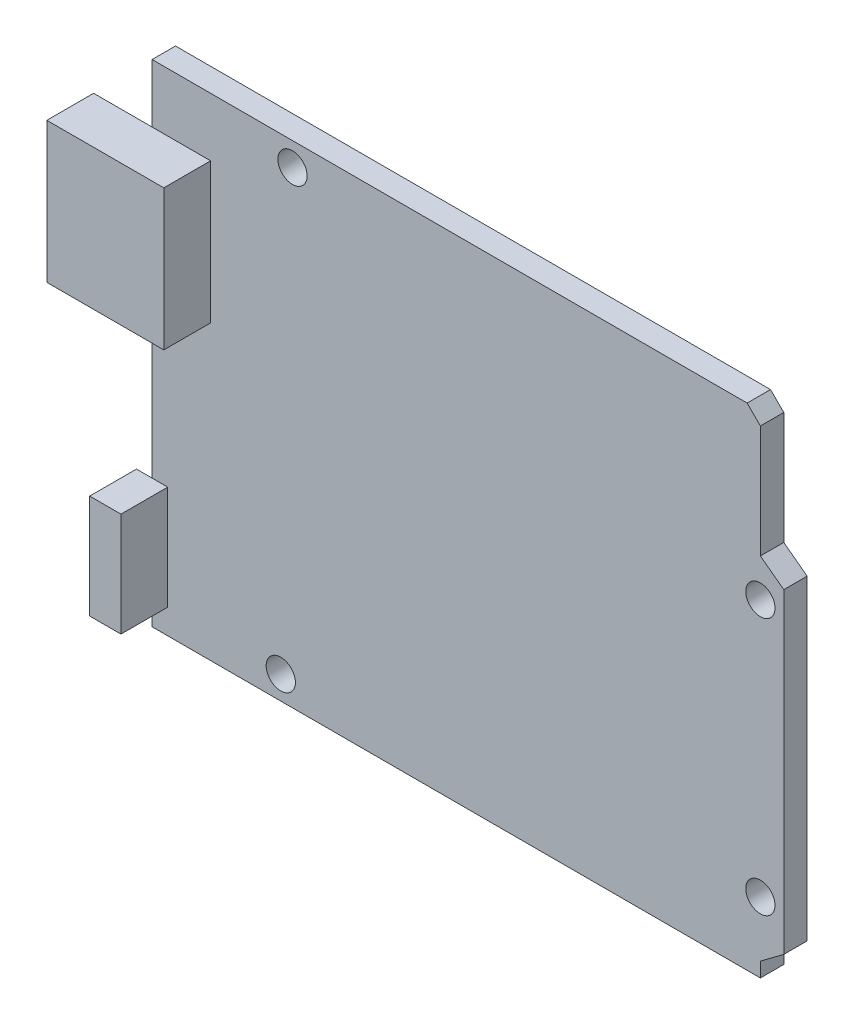
ISO-10303-21;
HEADER;
FILE_DESCRIPTION(('STEP AP214'),'2;1');
FILE_NAME('part.step','',(''),(''),'','','');
FILE_SCHEMA(('AUTOMOTIVE_DESIGN { 1 0 10303 214 1 1 1 1 }'));
ENDSEC;
DATA;
#1=APPLICATION_CONTEXT('core data for automotive mechanical design processes');
#2=APPLICATION_PROTOCOL_DEFINITION('international standard','automotive_design',2000,#1);
#3=PRODUCT_CONTEXT('',#1,'mechanical');
#4=PRODUCT('Part','Part','',(#3));
#5=PRODUCT_RELATED_PRODUCT_CATEGORY('part','',(#4));
#6=PRODUCT_DEFINITION_FORMATION('','',#4);
#7=PRODUCT_DEFINITION_CONTEXT('part definition',#1,'design');
#8=PRODUCT_DEFINITION('design','',#6,#7);
#9=PRODUCT_DEFINITION_SHAPE('','',#8);
#10=(LENGTH_UNIT() NAMED_UNIT(*) SI_UNIT(.MILLI.,.METRE.));
#11=(NAMED_UNIT(*) PLANE_ANGLE_UNIT() SI_UNIT($,.RADIAN.));
#12=(NAMED_UNIT(*) SI_UNIT($,.STERADIAN.) SOLID_ANGLE_UNIT());
#13=UNCERTAINTY_MEASURE_WITH_UNIT(LENGTH_MEASURE(1.E-05),#10,'distance_accuracy_value','');
#14=(GEOMETRIC_REPRESENTATION_CONTEXT(3) GLOBAL_UNCERTAINTY_ASSIGNED_CONTEXT((#13)) GLOBAL_UNIT_ASSIGNED_CONTEXT((#10,
#11,#12)) REPRESENTATION_CONTEXT('',''));
#15=CARTESIAN_POINT('',(0.,0.,0.));
#16=DIRECTION('',(0.,0.,1.));
#17=DIRECTION('',(1.,0.,0.));
#18=AXIS2_PLACEMENT_3D('',#15,#16,#17);
#19=CARTESIAN_POINT('',(0.,0.,2.54));
#20=DIRECTION('',(0.,0.,-1.));
#21=DIRECTION('',(-1.,0.,0.));
#22=AXIS2_PLACEMENT_3D('',#19,#20,#21);
#23=PLANE('',#22);
#24=CARTESIAN_POINT('',(-19.05,24.13,2.54));
#25=DIRECTION('',(0.,0.,1.));
#26=DIRECTION('',(1.,0.,0.));
#27=AXIS2_PLACEMENT_3D('',#24,#25,#26);
#28=CIRCLE('',#27,1.5875);
#29=CARTESIAN_POINT('',(-17.4625,24.13,2.54));
#30=VERTEX_POINT('',#29);
#31=EDGE_CURVE('E213',#30,#30,#28,.T.);
#32=ORIENTED_EDGE('',*,*,#31,.F.);
#33=EDGE_LOOP('',(#32));
#34=FACE_BOUND('',#33,.T.);
#35=CARTESIAN_POINT('',(31.75,-19.05,2.54));
#36=DIRECTION('',(0.,0.,1.));
#37=DIRECTION('',(1.,0.,0.));
#38=AXIS2_PLACEMENT_3D('',#35,#36,#37);
#39=CIRCLE('',#38,1.5875);
#40=CARTESIAN_POINT('',(33.3375,-19.05,2.54));
#41=VERTEX_POINT('',#40);
#42=EDGE_CURVE('E316',#41,#41,#39,.T.);
#43=ORIENTED_EDGE('',*,*,#42,.F.);
#44=EDGE_LOOP('',(#43));
#45=FACE_BOUND('',#44,.T.);
#46=CARTESIAN_POINT('',(31.75,8.89,2.54));
#47=DIRECTION('',(0.,0.,1.));
#48=DIRECTION('',(1.,0.,0.));
#49=AXIS2_PLACEMENT_3D('',#46,#47,#48);
#50=CIRCLE('',#49,1.5875);
#51=CARTESIAN_POINT('',(33.3375,8.89,2.54));
#52=VERTEX_POINT('',#51);
#53=EDGE_CURVE('E319',#52,#52,#50,.T.);
#54=ORIENTED_EDGE('',*,*,#53,.F.);
#55=EDGE_LOOP('',(#54));
#56=FACE_BOUND('',#55,.T.);
#57=CARTESIAN_POINT('',(-20.32,-24.13,2.54));
#58=DIRECTION('',(0.,0.,1.));
#59=DIRECTION('',(1.,0.,0.));
#60=AXIS2_PLACEMENT_3D('',#57,#58,#59);
#61=CIRCLE('',#60,1.5875);
#62=CARTESIAN_POINT('',(-18.7325,-24.13,2.54));
#63=VERTEX_POINT('',#62);
#64=EDGE_CURVE('E315',#63,#63,#61,.T.);
#65=ORIENTED_EDGE('',*,*,#64,.F.);
#66=EDGE_LOOP('',(#65));
#67=FACE_BOUND('',#66,.T.);
#68=DIRECTION('',(0.,1.,0.));
#69=VECTOR('',#68,1.);
#70=CARTESIAN_POINT('',(34.29,-26.67,2.54));
#71=LINE('',#70,#69);
#72=CARTESIAN_POINT('',(34.29,-23.1815470961268,2.54));
#73=VERTEX_POINT('',#72);
#74=CARTESIAN_POINT('',(34.29,11.1157964472055,2.54));
#75=VERTEX_POINT('',#74);
#76=EDGE_CURVE('E203',#73,#75,#71,.T.);
#77=ORIENTED_EDGE('',*,*,#76,.T.);
#78=DIRECTION('',(0.801223892096283,-0.598364667016765,0.));
#79=VECTOR('',#78,1.);
#80=CARTESIAN_POINT('',(31.75,13.0127022549518,2.54));
#81=LINE('',#80,#79);
#82=CARTESIAN_POINT('',(31.75,13.0127022549518,2.54));
#83=VERTEX_POINT('',#82);
#84=EDGE_CURVE('E175',#83,#75,#81,.T.);
#85=ORIENTED_EDGE('',*,*,#84,.F.);
#86=DIRECTION('',(0.,-1.,0.));
#87=VECTOR('',#86,1.);
#88=CARTESIAN_POINT('',(31.75,13.0127022549518,2.54));
#89=LINE('',#88,#87);
#90=CARTESIAN_POINT('',(31.75,25.2331590206289,2.54));
#91=VERTEX_POINT('',#90);
#92=EDGE_CURVE('E305',#91,#83,#89,.T.);
#93=ORIENTED_EDGE('',*,*,#92,.F.);
#94=DIRECTION('',(0.707106781186552,-0.707106781186543,0.));
#95=VECTOR('',#94,1.);
#96=CARTESIAN_POINT('',(30.3131590206289,26.67,2.54));
#97=LINE('',#96,#95);
#98=CARTESIAN_POINT('',(30.3131590206289,26.67,2.54));
#99=VERTEX_POINT('',#98);
#100=EDGE_CURVE('E302',#99,#91,#97,.T.);
#101=ORIENTED_EDGE('',*,*,#100,.F.);
#102=DIRECTION('',(-1.,0.,0.));
#103=VECTOR('',#102,1.);
#104=CARTESIAN_POINT('',(-34.29,26.67,2.54));
#105=LINE('',#104,#103);
#106=CARTESIAN_POINT('',(-34.29,26.67,2.54));
#107=VERTEX_POINT('',#106);
#108=EDGE_CURVE('E183',#99,#107,#105,.T.);
#109=ORIENTED_EDGE('',*,*,#108,.T.);
#110=DIRECTION('',(0.,-1.,0.));
#111=VECTOR('',#110,1.);
#112=CARTESIAN_POINT('',(-34.29,-26.67,2.54));
#113=LINE('',#112,#111);
#114=CARTESIAN_POINT('',(-34.29,20.32,2.54));
#115=VERTEX_POINT('',#114);
#116=EDGE_CURVE('E288',#107,#115,#113,.T.);
#117=ORIENTED_EDGE('',*,*,#116,.T.);
#118=DIRECTION('',(-1.,0.,0.));
#119=VECTOR('',#118,1.);
#120=CARTESIAN_POINT('',(-40.64,20.32,2.54));
#121=LINE('',#120,#119);
#122=CARTESIAN_POINT('',(-27.94,20.32,2.54));
#123=VERTEX_POINT('',#122);
#124=EDGE_CURVE('E268',#123,#115,#121,.T.);
#125=ORIENTED_EDGE('',*,*,#124,.F.);
#126=DIRECTION('',(0.,1.,0.));
#127=VECTOR('',#126,1.);
#128=CARTESIAN_POINT('',(-27.94,5.08,2.54));
#129=LINE('',#128,#127);
#130=CARTESIAN_POINT('',(-27.94,5.08,2.54));
#131=VERTEX_POINT('',#130);
#132=EDGE_CURVE('E254',#131,#123,#129,.T.);
#133=ORIENTED_EDGE('',*,*,#132,.F.);
#134=DIRECTION('',(1.,0.,0.));
#135=VECTOR('',#134,1.);
#136=CARTESIAN_POINT('',(-40.64,5.08,2.54));
#137=LINE('',#136,#135);
#138=CARTESIAN_POINT('',(-34.29,5.08,2.54));
#139=VERTEX_POINT('',#138);
#140=EDGE_CURVE('E11',#139,#131,#137,.T.);
#141=ORIENTED_EDGE('',*,*,#140,.F.);
#142=CARTESIAN_POINT('',(-34.29,-12.6860049869124,2.54));
#143=VERTEX_POINT('',#142);
#144=EDGE_CURVE('E355',#139,#143,#113,.T.);
#145=ORIENTED_EDGE('',*,*,#144,.T.);
#146=DIRECTION('',(-1.,0.,0.));
#147=VECTOR('',#146,1.);
#148=CARTESIAN_POINT('',(-35.9875181952427,-12.6860049869124,2.54));
#149=LINE('',#148,#147);
#150=CARTESIAN_POINT('',(-32.5924818047572,-12.6860049869124,2.54));
#151=VERTEX_POINT('',#150);
#152=EDGE_CURVE('E229',#151,#143,#149,.T.);
#153=ORIENTED_EDGE('',*,*,#152,.F.);
#154=DIRECTION('',(0.,1.,0.));
#155=VECTOR('',#154,1.);
#156=CARTESIAN_POINT('',(-32.5924818047572,-23.9715545871231,2.54));
#157=LINE('',#156,#155);
#158=CARTESIAN_POINT('',(-32.5924818047572,-23.9715545871231,2.54));
#159=VERTEX_POINT('',#158);
#160=EDGE_CURVE('E220',#159,#151,#157,.T.);
#161=ORIENTED_EDGE('',*,*,#160,.F.);
#162=DIRECTION('',(1.,0.,0.));
#163=VECTOR('',#162,1.);
#164=CARTESIAN_POINT('',(-35.9875181952427,-23.9715545871231,2.54));
#165=LINE('',#164,#163);
#166=CARTESIAN_POINT('',(-34.29,-23.9715545871231,2.54));
#167=VERTEX_POINT('',#166);
#168=EDGE_CURVE('E238',#167,#159,#165,.T.);
#169=ORIENTED_EDGE('',*,*,#168,.F.);
#170=CARTESIAN_POINT('',(-34.29,-26.67,2.54));
#171=VERTEX_POINT('',#170);
#172=EDGE_CURVE('E287',#167,#171,#113,.T.);
#173=ORIENTED_EDGE('',*,*,#172,.T.);
#174=DIRECTION('',(1.,0.,0.));
#175=VECTOR('',#174,1.);
#176=CARTESIAN_POINT('',(-34.29,-26.67,2.54));
#177=LINE('',#176,#175);
#178=CARTESIAN_POINT('',(31.75,-26.67,2.54));
#179=VERTEX_POINT('',#178);
#180=EDGE_CURVE('E207',#171,#179,#177,.T.);
#181=ORIENTED_EDGE('',*,*,#180,.T.);
#182=DIRECTION('',(0.,-1.,0.));
#183=VECTOR('',#182,1.);
#184=CARTESIAN_POINT('',(31.75,-25.0784529038732,2.54));
#185=LINE('',#184,#183);
#186=CARTESIAN_POINT('',(31.75,-25.0784529038732,2.54));
#187=VERTEX_POINT('',#186);
#188=EDGE_CURVE('E295',#187,#179,#185,.T.);
#189=ORIENTED_EDGE('',*,*,#188,.F.);
#190=DIRECTION('',(-0.801223892096282,-0.598364667016766,0.));
#191=VECTOR('',#190,1.);
#192=CARTESIAN_POINT('',(34.29,-23.1815470961268,2.54));
#193=LINE('',#192,#191);
#194=EDGE_CURVE('E616',#73,#187,#193,.T.);
#195=ORIENTED_EDGE('',*,*,#194,.F.);
#196=EDGE_LOOP('',(#77,#85,#93,#101,#109,#117,#125,#133,#141,#145,#153,#161,#169,#173,#181,#189,#195));
#197=FACE_BOUND('',#196,.T.);
#198=ADVANCED_FACE('F33',(#34,#45,#56,#67,#197),#23,.F.);
#199=CARTESIAN_POINT('',(34.29,-26.67,2.54));
#200=DIRECTION('',(-1.,0.,0.));
#201=DIRECTION('',(0.,0.,1.));
#202=AXIS2_PLACEMENT_3D('',#199,#200,#201);
#203=PLANE('',#202);
#204=DIRECTION('',(0.,1.,0.));
#205=VECTOR('',#204,1.);
#206=CARTESIAN_POINT('',(34.29,-26.67,0.));
#207=LINE('',#206,#205);
#208=CARTESIAN_POINT('',(34.29,-23.1815470961268,0.));
#209=VERTEX_POINT('',#208);
#210=CARTESIAN_POINT('',(34.29,11.1157964472055,0.));
#211=VERTEX_POINT('',#210);
#212=EDGE_CURVE('E192',#209,#211,#207,.T.);
#213=ORIENTED_EDGE('',*,*,#212,.T.);
#214=DIRECTION('',(0.,0.,1.));
#215=VECTOR('',#214,1.);
#216=CARTESIAN_POINT('',(34.29,11.1157964472055,0.));
#217=LINE('',#216,#215);
#218=EDGE_CURVE('E320',#211,#75,#217,.T.);
#219=ORIENTED_EDGE('',*,*,#218,.T.);
#220=ORIENTED_EDGE('',*,*,#76,.F.);
#221=DIRECTION('',(0.,0.,1.));
#222=VECTOR('',#221,1.);
#223=CARTESIAN_POINT('',(34.29,-23.1815470961268,0.));
#224=LINE('',#223,#222);
#225=EDGE_CURVE('E307',#209,#73,#224,.T.);
#226=ORIENTED_EDGE('',*,*,#225,.F.);
#227=EDGE_LOOP('',(#213,#219,#220,#226));
#228=FACE_BOUND('',#227,.T.);
#229=ADVANCED_FACE('F35',(#228),#203,.F.);
#230=CARTESIAN_POINT('',(-34.29,26.67,2.54));
#231=DIRECTION('',(0.,-1.,0.));
#232=DIRECTION('',(0.,0.,-1.));
#233=AXIS2_PLACEMENT_3D('',#230,#231,#232);
#234=PLANE('',#233);
#235=ORIENTED_EDGE('',*,*,#108,.F.);
#236=DIRECTION('',(0.,0.,1.));
#237=VECTOR('',#236,1.);
#238=CARTESIAN_POINT('',(30.3131590206289,26.67,0.));
#239=LINE('',#238,#237);
#240=CARTESIAN_POINT('',(30.3131590206289,26.67,0.));
#241=VERTEX_POINT('',#240);
#242=EDGE_CURVE('E170',#241,#99,#239,.T.);
#243=ORIENTED_EDGE('',*,*,#242,.F.);
#244=DIRECTION('',(-1.,0.,0.));
#245=VECTOR('',#244,1.);
#246=CARTESIAN_POINT('',(-34.29,26.67,0.));
#247=LINE('',#246,#245);
#248=CARTESIAN_POINT('',(-34.29,26.67,0.));
#249=VERTEX_POINT('',#248);
#250=EDGE_CURVE('E181',#241,#249,#247,.T.);
#251=ORIENTED_EDGE('',*,*,#250,.T.);
#252=DIRECTION('',(0.,0.,-1.));
#253=VECTOR('',#252,1.);
#254=CARTESIAN_POINT('',(-34.29,26.67,2.54));
#255=LINE('',#254,#253);
#256=EDGE_CURVE('E42',#107,#249,#255,.T.);
#257=ORIENTED_EDGE('',*,*,#256,.F.);
#258=EDGE_LOOP('',(#235,#243,#251,#257));
#259=FACE_BOUND('',#258,.T.);
#260=ADVANCED_FACE('F179',(#259),#234,.F.);
#261=CARTESIAN_POINT('',(-34.29,-26.67,2.54));
#262=DIRECTION('',(1.,0.,0.));
#263=DIRECTION('',(0.,0.,-1.));
#264=AXIS2_PLACEMENT_3D('',#261,#262,#263);
#265=PLANE('',#264);
#266=DIRECTION('',(0.,-1.,0.));
#267=VECTOR('',#266,1.);
#268=CARTESIAN_POINT('',(-34.29,-26.67,0.));
#269=LINE('',#268,#267);
#270=CARTESIAN_POINT('',(-34.29,-26.67,0.));
#271=VERTEX_POINT('',#270);
#272=EDGE_CURVE('E191',#249,#271,#269,.T.);
#273=ORIENTED_EDGE('',*,*,#272,.T.);
#274=DIRECTION('',(0.,0.,-1.));
#275=VECTOR('',#274,1.);
#276=CARTESIAN_POINT('',(-34.29,-26.67,2.54));
#277=LINE('',#276,#275);
#278=EDGE_CURVE('E204',#171,#271,#277,.T.);
#279=ORIENTED_EDGE('',*,*,#278,.F.);
#280=ORIENTED_EDGE('',*,*,#172,.F.);
#281=EDGE_CURVE('E351',#143,#167,#113,.T.);
#282=ORIENTED_EDGE('',*,*,#281,.F.);
#283=ORIENTED_EDGE('',*,*,#144,.F.);
#284=EDGE_CURVE('E289',#115,#139,#113,.T.);
#285=ORIENTED_EDGE('',*,*,#284,.F.);
#286=ORIENTED_EDGE('',*,*,#116,.F.);
#287=ORIENTED_EDGE('',*,*,#256,.T.);
#288=EDGE_LOOP('',(#273,#279,#280,#282,#283,#285,#286,#287));
#289=FACE_BOUND('',#288,.T.);
#290=ADVANCED_FACE('F376',(#289),#265,.F.);
#291=CARTESIAN_POINT('',(-34.29,-26.67,2.54));
#292=DIRECTION('',(0.,1.,0.));
#293=DIRECTION('',(0.,0.,1.));
#294=AXIS2_PLACEMENT_3D('',#291,#292,#293);
#295=PLANE('',#294);
#296=DIRECTION('',(1.,0.,0.));
#297=VECTOR('',#296,1.);
#298=CARTESIAN_POINT('',(-34.29,-26.67,0.));
#299=LINE('',#298,#297);
#300=CARTESIAN_POINT('',(31.75,-26.67,0.));
#301=VERTEX_POINT('',#300);
#302=EDGE_CURVE('E194',#271,#301,#299,.T.);
#303=ORIENTED_EDGE('',*,*,#302,.T.);
#304=DIRECTION('',(0.,0.,1.));
#305=VECTOR('',#304,1.);
#306=CARTESIAN_POINT('',(31.75,-26.67,0.));
#307=LINE('',#306,#305);
#308=EDGE_CURVE('E301',#301,#179,#307,.T.);
#309=ORIENTED_EDGE('',*,*,#308,.T.);
#310=ORIENTED_EDGE('',*,*,#180,.F.);
#311=ORIENTED_EDGE('',*,*,#278,.T.);
#312=EDGE_LOOP('',(#303,#309,#310,#311));
#313=FACE_BOUND('',#312,.T.);
#314=ADVANCED_FACE('F300',(#313),#295,.F.);
#315=CARTESIAN_POINT('',(0.,0.,0.));
#316=DIRECTION('',(0.,0.,-1.));
#317=DIRECTION('',(-1.,0.,0.));
#318=AXIS2_PLACEMENT_3D('',#315,#316,#317);
#319=PLANE('',#318);
#320=DIRECTION('',(0.801223892096283,-0.598364667016765,0.));
#321=VECTOR('',#320,1.);
#322=CARTESIAN_POINT('',(31.75,13.0127022549518,0.));
#323=LINE('',#322,#321);
#324=CARTESIAN_POINT('',(31.75,13.0127022549518,0.));
#325=VERTEX_POINT('',#324);
#326=EDGE_CURVE('E184',#325,#211,#323,.T.);
#327=ORIENTED_EDGE('',*,*,#326,.T.);
#328=ORIENTED_EDGE('',*,*,#212,.F.);
#329=DIRECTION('',(-0.801223892096282,-0.598364667016766,0.));
#330=VECTOR('',#329,1.);
#331=CARTESIAN_POINT('',(34.29,-23.1815470961268,0.));
#332=LINE('',#331,#330);
#333=CARTESIAN_POINT('',(31.75,-25.0784529038732,0.));
#334=VERTEX_POINT('',#333);
#335=EDGE_CURVE('E613',#209,#334,#332,.T.);
#336=ORIENTED_EDGE('',*,*,#335,.T.);
#337=DIRECTION('',(0.,-1.,0.));
#338=VECTOR('',#337,1.);
#339=CARTESIAN_POINT('',(31.75,-25.0784529038732,0.));
#340=LINE('',#339,#338);
#341=EDGE_CURVE('E59',#334,#301,#340,.T.);
#342=ORIENTED_EDGE('',*,*,#341,.T.);
#343=ORIENTED_EDGE('',*,*,#302,.F.);
#344=ORIENTED_EDGE('',*,*,#272,.F.);
#345=ORIENTED_EDGE('',*,*,#250,.F.);
#346=DIRECTION('',(0.707106781186552,-0.707106781186543,0.));
#347=VECTOR('',#346,1.);
#348=CARTESIAN_POINT('',(30.3131590206289,26.67,0.));
#349=LINE('',#348,#347);
#350=CARTESIAN_POINT('',(31.75,25.2331590206289,0.));
#351=VERTEX_POINT('',#350);
#352=EDGE_CURVE('E166',#241,#351,#349,.T.);
#353=ORIENTED_EDGE('',*,*,#352,.T.);
#354=DIRECTION('',(0.,-1.,0.));
#355=VECTOR('',#354,1.);
#356=CARTESIAN_POINT('',(31.75,13.0127022549518,0.));
#357=LINE('',#356,#355);
#358=EDGE_CURVE('E51',#351,#325,#357,.T.);
#359=ORIENTED_EDGE('',*,*,#358,.T.);
#360=EDGE_LOOP('',(#327,#328,#336,#342,#343,#344,#345,#353,#359));
#361=FACE_BOUND('',#360,.T.);
#362=CARTESIAN_POINT('',(-19.05,24.13,0.));
#363=DIRECTION('',(0.,0.,-1.));
#364=DIRECTION('',(-1.,0.,0.));
#365=AXIS2_PLACEMENT_3D('',#362,#363,#364);
#366=CIRCLE('',#365,1.5875);
#367=CARTESIAN_POINT('',(-20.6375,24.13,0.));
#368=VERTEX_POINT('',#367);
#369=EDGE_CURVE('E37',#368,#368,#366,.T.);
#370=ORIENTED_EDGE('',*,*,#369,.F.);
#371=EDGE_LOOP('',(#370));
#372=FACE_BOUND('',#371,.T.);
#373=CARTESIAN_POINT('',(31.75,-19.05,0.));
#374=DIRECTION('',(0.,0.,-1.));
#375=DIRECTION('',(-1.,0.,0.));
#376=AXIS2_PLACEMENT_3D('',#373,#374,#375);
#377=CIRCLE('',#376,1.5875);
#378=CARTESIAN_POINT('',(30.1625,-19.05,0.));
#379=VERTEX_POINT('',#378);
#380=EDGE_CURVE('E215',#379,#379,#377,.T.);
#381=ORIENTED_EDGE('',*,*,#380,.F.);
#382=EDGE_LOOP('',(#381));
#383=FACE_BOUND('',#382,.T.);
#384=CARTESIAN_POINT('',(31.75,8.89,0.));
#385=DIRECTION('',(0.,0.,-1.));
#386=DIRECTION('',(-1.,0.,0.));
#387=AXIS2_PLACEMENT_3D('',#384,#385,#386);
#388=CIRCLE('',#387,1.5875);
#389=CARTESIAN_POINT('',(30.1625,8.89,0.));
#390=VERTEX_POINT('',#389);
#391=EDGE_CURVE('E212',#390,#390,#388,.T.);
#392=ORIENTED_EDGE('',*,*,#391,.F.);
#393=EDGE_LOOP('',(#392));
#394=FACE_BOUND('',#393,.T.);
#395=CARTESIAN_POINT('',(-20.32,-24.13,0.));
#396=DIRECTION('',(0.,0.,-1.));
#397=DIRECTION('',(-1.,0.,0.));
#398=AXIS2_PLACEMENT_3D('',#395,#396,#397);
#399=CIRCLE('',#398,1.5875);
#400=CARTESIAN_POINT('',(-21.9075,-24.13,0.));
#401=VERTEX_POINT('',#400);
#402=EDGE_CURVE('E209',#401,#401,#399,.T.);
#403=ORIENTED_EDGE('',*,*,#402,.F.);
#404=EDGE_LOOP('',(#403));
#405=FACE_BOUND('',#404,.T.);
#406=ADVANCED_FACE('F188',(#361,#372,#383,#394,#405),#319,.T.);
#407=CARTESIAN_POINT('',(-27.94,5.08,7.62));
#408=DIRECTION('',(-1.,0.,0.));
#409=DIRECTION('',(0.,0.,1.));
#410=AXIS2_PLACEMENT_3D('',#407,#408,#409);
#411=PLANE('',#410);
#412=ORIENTED_EDGE('',*,*,#132,.T.);
#413=DIRECTION('',(0.,0.,-1.));
#414=VECTOR('',#413,1.);
#415=CARTESIAN_POINT('',(-27.94,20.32,7.62));
#416=LINE('',#415,#414);
#417=CARTESIAN_POINT('',(-27.94,20.32,7.62));
#418=VERTEX_POINT('',#417);
#419=EDGE_CURVE('E197',#418,#123,#416,.T.);
#420=ORIENTED_EDGE('',*,*,#419,.F.);
#421=DIRECTION('',(0.,1.,0.));
#422=VECTOR('',#421,1.);
#423=CARTESIAN_POINT('',(-27.94,5.08,7.62));
#424=LINE('',#423,#422);
#425=CARTESIAN_POINT('',(-27.94,5.08,7.62));
#426=VERTEX_POINT('',#425);
#427=EDGE_CURVE('E255',#426,#418,#424,.T.);
#428=ORIENTED_EDGE('',*,*,#427,.F.);
#429=DIRECTION('',(0.,0.,-1.));
#430=VECTOR('',#429,1.);
#431=CARTESIAN_POINT('',(-27.94,5.08,7.62));
#432=LINE('',#431,#430);
#433=EDGE_CURVE('E264',#426,#131,#432,.T.);
#434=ORIENTED_EDGE('',*,*,#433,.T.);
#435=EDGE_LOOP('',(#412,#420,#428,#434));
#436=FACE_BOUND('',#435,.T.);
#437=ADVANCED_FACE('F395',(#436),#411,.F.);
#438=CARTESIAN_POINT('',(-40.64,20.32,7.62));
#439=DIRECTION('',(0.,-1.,0.));
#440=DIRECTION('',(0.,0.,-1.));
#441=AXIS2_PLACEMENT_3D('',#438,#439,#440);
#442=PLANE('',#441);
#443=ORIENTED_EDGE('',*,*,#124,.T.);
#444=CARTESIAN_POINT('',(-40.64,20.32,2.54));
#445=VERTEX_POINT('',#444);
#446=EDGE_CURVE('E267',#115,#445,#121,.T.);
#447=ORIENTED_EDGE('',*,*,#446,.T.);
#448=DIRECTION('',(0.,0.,-1.));
#449=VECTOR('',#448,1.);
#450=CARTESIAN_POINT('',(-40.64,20.32,7.62));
#451=LINE('',#450,#449);
#452=CARTESIAN_POINT('',(-40.64,20.32,7.62));
#453=VERTEX_POINT('',#452);
#454=EDGE_CURVE('E279',#453,#445,#451,.T.);
#455=ORIENTED_EDGE('',*,*,#454,.F.);
#456=DIRECTION('',(-1.,0.,0.));
#457=VECTOR('',#456,1.);
#458=CARTESIAN_POINT('',(-40.64,20.32,7.62));
#459=LINE('',#458,#457);
#460=EDGE_CURVE('E258',#418,#453,#459,.T.);
#461=ORIENTED_EDGE('',*,*,#460,.F.);
#462=ORIENTED_EDGE('',*,*,#419,.T.);
#463=EDGE_LOOP('',(#443,#447,#455,#461,#462));
#464=FACE_BOUND('',#463,.T.);
#465=ADVANCED_FACE('F374',(#464),#442,.F.);
#466=CARTESIAN_POINT('',(-40.64,5.08,7.62));
#467=DIRECTION('',(1.,0.,0.));
#468=DIRECTION('',(0.,0.,-1.));
#469=AXIS2_PLACEMENT_3D('',#466,#467,#468);
#470=PLANE('',#469);
#471=DIRECTION('',(0.,-1.,0.));
#472=VECTOR('',#471,1.);
#473=CARTESIAN_POINT('',(-40.64,5.08,2.54));
#474=LINE('',#473,#472);
#475=CARTESIAN_POINT('',(-40.64,5.08,2.54));
#476=VERTEX_POINT('',#475);
#477=EDGE_CURVE('E271',#445,#476,#474,.T.);
#478=ORIENTED_EDGE('',*,*,#477,.T.);
#479=DIRECTION('',(0.,0.,-1.));
#480=VECTOR('',#479,1.);
#481=CARTESIAN_POINT('',(-40.64,5.08,7.62));
#482=LINE('',#481,#480);
#483=CARTESIAN_POINT('',(-40.64,5.08,7.62));
#484=VERTEX_POINT('',#483);
#485=EDGE_CURVE('E276',#484,#476,#482,.T.);
#486=ORIENTED_EDGE('',*,*,#485,.F.);
#487=DIRECTION('',(0.,-1.,0.));
#488=VECTOR('',#487,1.);
#489=CARTESIAN_POINT('',(-40.64,5.08,7.62));
#490=LINE('',#489,#488);
#491=EDGE_CURVE('E260',#453,#484,#490,.T.);
#492=ORIENTED_EDGE('',*,*,#491,.F.);
#493=ORIENTED_EDGE('',*,*,#454,.T.);
#494=EDGE_LOOP('',(#478,#486,#492,#493));
#495=FACE_BOUND('',#494,.T.);
#496=ADVANCED_FACE('F371',(#495),#470,.F.);
#497=CARTESIAN_POINT('',(-40.64,5.08,7.62));
#498=DIRECTION('',(0.,1.,0.));
#499=DIRECTION('',(0.,0.,1.));
#500=AXIS2_PLACEMENT_3D('',#497,#498,#499);
#501=PLANE('',#500);
#502=EDGE_CURVE('E44',#476,#139,#137,.T.);
#503=ORIENTED_EDGE('',*,*,#502,.T.);
#504=ORIENTED_EDGE('',*,*,#140,.T.);
#505=ORIENTED_EDGE('',*,*,#433,.F.);
#506=DIRECTION('',(1.,0.,0.));
#507=VECTOR('',#506,1.);
#508=CARTESIAN_POINT('',(-40.64,5.08,7.62));
#509=LINE('',#508,#507);
#510=EDGE_CURVE('E262',#484,#426,#509,.T.);
#511=ORIENTED_EDGE('',*,*,#510,.F.);
#512=ORIENTED_EDGE('',*,*,#485,.T.);
#513=EDGE_LOOP('',(#503,#504,#505,#511,#512));
#514=FACE_BOUND('',#513,.T.);
#515=ADVANCED_FACE('F365',(#514),#501,.F.);
#516=CARTESIAN_POINT('',(0.,0.,7.62));
#517=DIRECTION('',(0.,0.,-1.));
#518=DIRECTION('',(-1.,0.,0.));
#519=AXIS2_PLACEMENT_3D('',#516,#517,#518);
#520=PLANE('',#519);
#521=ORIENTED_EDGE('',*,*,#427,.T.);
#522=ORIENTED_EDGE('',*,*,#460,.T.);
#523=ORIENTED_EDGE('',*,*,#491,.T.);
#524=ORIENTED_EDGE('',*,*,#510,.T.);
#525=EDGE_LOOP('',(#521,#522,#523,#524));
#526=FACE_BOUND('',#525,.T.);
#527=ADVANCED_FACE('F407',(#526),#520,.F.);
#528=CARTESIAN_POINT('',(0.,0.,2.54));
#529=DIRECTION('',(0.,0.,-1.));
#530=DIRECTION('',(-1.,0.,0.));
#531=AXIS2_PLACEMENT_3D('',#528,#529,#530);
#532=PLANE('',#531);
#533=ORIENTED_EDGE('',*,*,#446,.F.);
#534=ORIENTED_EDGE('',*,*,#284,.T.);
#535=ORIENTED_EDGE('',*,*,#502,.F.);
#536=ORIENTED_EDGE('',*,*,#477,.F.);
#537=EDGE_LOOP('',(#533,#534,#535,#536));
#538=FACE_BOUND('',#537,.T.);
#539=ADVANCED_FACE('F361',(#538),#532,.T.);
#540=CARTESIAN_POINT('',(0.,0.,2.54));
#541=DIRECTION('',(0.,0.,-1.));
#542=DIRECTION('',(-1.,0.,0.));
#543=AXIS2_PLACEMENT_3D('',#540,#541,#542);
#544=PLANE('',#543);
#545=ORIENTED_EDGE('',*,*,#281,.T.);
#546=CARTESIAN_POINT('',(-35.9875181952427,-23.9715545871231,2.54));
#547=VERTEX_POINT('',#546);
#548=EDGE_CURVE('E239',#547,#167,#165,.T.);
#549=ORIENTED_EDGE('',*,*,#548,.F.);
#550=DIRECTION('',(0.,-1.,0.));
#551=VECTOR('',#550,1.);
#552=CARTESIAN_POINT('',(-35.9875181952427,-23.9715545871231,2.54));
#553=LINE('',#552,#551);
#554=CARTESIAN_POINT('',(-35.9875181952427,-12.6860049869124,2.54));
#555=VERTEX_POINT('',#554);
#556=EDGE_CURVE('E236',#555,#547,#553,.T.);
#557=ORIENTED_EDGE('',*,*,#556,.F.);
#558=EDGE_CURVE('E224',#143,#555,#149,.T.);
#559=ORIENTED_EDGE('',*,*,#558,.F.);
#560=EDGE_LOOP('',(#545,#549,#557,#559));
#561=FACE_BOUND('',#560,.T.);
#562=ADVANCED_FACE('F350',(#561),#544,.T.);
#563=CARTESIAN_POINT('',(-32.5924818047572,-23.9715545871231,7.62));
#564=DIRECTION('',(-1.,0.,0.));
#565=DIRECTION('',(0.,0.,1.));
#566=AXIS2_PLACEMENT_3D('',#563,#564,#565);
#567=PLANE('',#566);
#568=ORIENTED_EDGE('',*,*,#160,.T.);
#569=DIRECTION('',(0.,0.,-1.));
#570=VECTOR('',#569,1.);
#571=CARTESIAN_POINT('',(-32.5924818047572,-12.6860049869124,7.62));
#572=LINE('',#571,#570);
#573=CARTESIAN_POINT('',(-32.5924818047572,-12.6860049869124,7.62));
#574=VERTEX_POINT('',#573);
#575=EDGE_CURVE('E251',#574,#151,#572,.T.);
#576=ORIENTED_EDGE('',*,*,#575,.F.);
#577=DIRECTION('',(0.,1.,0.));
#578=VECTOR('',#577,1.);
#579=CARTESIAN_POINT('',(-32.5924818047572,-23.9715545871231,7.62));
#580=LINE('',#579,#578);
#581=CARTESIAN_POINT('',(-32.5924818047572,-23.9715545871231,7.62));
#582=VERTEX_POINT('',#581);
#583=EDGE_CURVE('E242',#582,#574,#580,.T.);
#584=ORIENTED_EDGE('',*,*,#583,.F.);
#585=DIRECTION('',(0.,0.,-1.));
#586=VECTOR('',#585,1.);
#587=CARTESIAN_POINT('',(-32.5924818047572,-23.9715545871231,7.62));
#588=LINE('',#587,#586);
#589=EDGE_CURVE('E243',#582,#159,#588,.T.);
#590=ORIENTED_EDGE('',*,*,#589,.T.);
#591=EDGE_LOOP('',(#568,#576,#584,#590));
#592=FACE_BOUND('',#591,.T.);
#593=ADVANCED_FACE('F339',(#592),#567,.F.);
#594=CARTESIAN_POINT('',(-35.9875181952427,-12.6860049869124,7.62));
#595=DIRECTION('',(0.,-1.,0.));
#596=DIRECTION('',(0.,0.,-1.));
#597=AXIS2_PLACEMENT_3D('',#594,#595,#596);
#598=PLANE('',#597);
#599=ORIENTED_EDGE('',*,*,#152,.T.);
#600=ORIENTED_EDGE('',*,*,#558,.T.);
#601=DIRECTION('',(0.,0.,-1.));
#602=VECTOR('',#601,1.);
#603=CARTESIAN_POINT('',(-35.9875181952427,-12.6860049869124,7.62));
#604=LINE('',#603,#602);
#605=CARTESIAN_POINT('',(-35.9875181952427,-12.6860049869124,7.62));
#606=VERTEX_POINT('',#605);
#607=EDGE_CURVE('E248',#606,#555,#604,.T.);
#608=ORIENTED_EDGE('',*,*,#607,.F.);
#609=DIRECTION('',(-1.,0.,0.));
#610=VECTOR('',#609,1.);
#611=CARTESIAN_POINT('',(-35.9875181952427,-12.6860049869124,7.62));
#612=LINE('',#611,#610);
#613=EDGE_CURVE('E327',#574,#606,#612,.T.);
#614=ORIENTED_EDGE('',*,*,#613,.F.);
#615=ORIENTED_EDGE('',*,*,#575,.T.);
#616=EDGE_LOOP('',(#599,#600,#608,#614,#615));
#617=FACE_BOUND('',#616,.T.);
#618=ADVANCED_FACE('F341',(#617),#598,.F.);
#619=CARTESIAN_POINT('',(-35.9875181952427,-23.9715545871231,7.62));
#620=DIRECTION('',(1.,0.,0.));
#621=DIRECTION('',(0.,0.,-1.));
#622=AXIS2_PLACEMENT_3D('',#619,#620,#621);
#623=PLANE('',#622);
#624=ORIENTED_EDGE('',*,*,#556,.T.);
#625=DIRECTION('',(0.,0.,-1.));
#626=VECTOR('',#625,1.);
#627=CARTESIAN_POINT('',(-35.9875181952427,-23.9715545871231,7.62));
#628=LINE('',#627,#626);
#629=CARTESIAN_POINT('',(-35.9875181952427,-23.9715545871231,7.62));
#630=VERTEX_POINT('',#629);
#631=EDGE_CURVE('E245',#630,#547,#628,.T.);
#632=ORIENTED_EDGE('',*,*,#631,.F.);
#633=DIRECTION('',(0.,-1.,0.));
#634=VECTOR('',#633,1.);
#635=CARTESIAN_POINT('',(-35.9875181952427,-23.9715545871231,7.62));
#636=LINE('',#635,#634);
#637=EDGE_CURVE('E328',#606,#630,#636,.T.);
#638=ORIENTED_EDGE('',*,*,#637,.F.);
#639=ORIENTED_EDGE('',*,*,#607,.T.);
#640=EDGE_LOOP('',(#624,#632,#638,#639));
#641=FACE_BOUND('',#640,.T.);
#642=ADVANCED_FACE('F346',(#641),#623,.F.);
#643=CARTESIAN_POINT('',(-35.9875181952427,-23.9715545871231,7.62));
#644=DIRECTION('',(0.,1.,0.));
#645=DIRECTION('',(0.,0.,1.));
#646=AXIS2_PLACEMENT_3D('',#643,#644,#645);
#647=PLANE('',#646);
#648=ORIENTED_EDGE('',*,*,#548,.T.);
#649=ORIENTED_EDGE('',*,*,#168,.T.);
#650=ORIENTED_EDGE('',*,*,#589,.F.);
#651=DIRECTION('',(1.,0.,0.));
#652=VECTOR('',#651,1.);
#653=CARTESIAN_POINT('',(-35.9875181952427,-23.9715545871231,7.62));
#654=LINE('',#653,#652);
#655=EDGE_CURVE('E232',#630,#582,#654,.T.);
#656=ORIENTED_EDGE('',*,*,#655,.F.);
#657=ORIENTED_EDGE('',*,*,#631,.T.);
#658=EDGE_LOOP('',(#648,#649,#650,#656,#657));
#659=FACE_BOUND('',#658,.T.);
#660=ADVANCED_FACE('F338',(#659),#647,.F.);
#661=CARTESIAN_POINT('',(0.,0.,7.62));
#662=DIRECTION('',(0.,0.,-1.));
#663=DIRECTION('',(-1.,0.,0.));
#664=AXIS2_PLACEMENT_3D('',#661,#662,#663);
#665=PLANE('',#664);
#666=ORIENTED_EDGE('',*,*,#583,.T.);
#667=ORIENTED_EDGE('',*,*,#613,.T.);
#668=ORIENTED_EDGE('',*,*,#637,.T.);
#669=ORIENTED_EDGE('',*,*,#655,.T.);
#670=EDGE_LOOP('',(#666,#667,#668,#669));
#671=FACE_BOUND('',#670,.T.);
#672=ADVANCED_FACE('F334',(#671),#665,.F.);
#673=CARTESIAN_POINT('',(-20.32,-24.13,-7.62));
#674=DIRECTION('',(0.,0.,1.));
#675=DIRECTION('',(1.,0.,0.));
#676=AXIS2_PLACEMENT_3D('',#673,#674,#675);
#677=CYLINDRICAL_SURFACE('',#676,1.5875);
#678=ORIENTED_EDGE('',*,*,#402,.T.);
#679=EDGE_LOOP('',(#678));
#680=FACE_BOUND('',#679,.T.);
#681=ORIENTED_EDGE('',*,*,#64,.T.);
#682=EDGE_LOOP('',(#681));
#683=FACE_BOUND('',#682,.T.);
#684=ADVANCED_FACE('F485',(#680,#683),#677,.F.);
#685=CARTESIAN_POINT('',(31.75,8.89,-7.62));
#686=DIRECTION('',(0.,0.,1.));
#687=DIRECTION('',(1.,0.,0.));
#688=AXIS2_PLACEMENT_3D('',#685,#686,#687);
#689=CYLINDRICAL_SURFACE('',#688,1.5875);
#690=ORIENTED_EDGE('',*,*,#391,.T.);
#691=EDGE_LOOP('',(#690));
#692=FACE_BOUND('',#691,.T.);
#693=ORIENTED_EDGE('',*,*,#53,.T.);
#694=EDGE_LOOP('',(#693));
#695=FACE_BOUND('',#694,.T.);
#696=ADVANCED_FACE('F494',(#692,#695),#689,.F.);
#697=CARTESIAN_POINT('',(31.75,-19.05,-7.62));
#698=DIRECTION('',(0.,0.,1.));
#699=DIRECTION('',(1.,0.,0.));
#700=AXIS2_PLACEMENT_3D('',#697,#698,#699);
#701=CYLINDRICAL_SURFACE('',#700,1.5875);
#702=ORIENTED_EDGE('',*,*,#380,.T.);
#703=EDGE_LOOP('',(#702));
#704=FACE_BOUND('',#703,.T.);
#705=ORIENTED_EDGE('',*,*,#42,.T.);
#706=EDGE_LOOP('',(#705));
#707=FACE_BOUND('',#706,.T.);
#708=ADVANCED_FACE('F504',(#704,#707),#701,.F.);
#709=CARTESIAN_POINT('',(-19.05,24.13,-7.62));
#710=DIRECTION('',(0.,0.,1.));
#711=DIRECTION('',(1.,0.,0.));
#712=AXIS2_PLACEMENT_3D('',#709,#710,#711);
#713=CYLINDRICAL_SURFACE('',#712,1.5875);
#714=ORIENTED_EDGE('',*,*,#369,.T.);
#715=EDGE_LOOP('',(#714));
#716=FACE_BOUND('',#715,.T.);
#717=ORIENTED_EDGE('',*,*,#31,.T.);
#718=EDGE_LOOP('',(#717));
#719=FACE_BOUND('',#718,.T.);
#720=ADVANCED_FACE('F514',(#716,#719),#713,.F.);
#721=CARTESIAN_POINT('',(31.75,-25.0784529038732,0.));
#722=DIRECTION('',(-1.,0.,0.));
#723=DIRECTION('',(0.,0.,1.));
#724=AXIS2_PLACEMENT_3D('',#721,#722,#723);
#725=PLANE('',#724);
#726=ORIENTED_EDGE('',*,*,#188,.T.);
#727=ORIENTED_EDGE('',*,*,#308,.F.);
#728=ORIENTED_EDGE('',*,*,#341,.F.);
#729=DIRECTION('',(0.,0.,1.));
#730=VECTOR('',#729,1.);
#731=CARTESIAN_POINT('',(31.75,-25.0784529038732,0.));
#732=LINE('',#731,#730);
#733=EDGE_CURVE('E303',#334,#187,#732,.T.);
#734=ORIENTED_EDGE('',*,*,#733,.T.);
#735=EDGE_LOOP('',(#726,#727,#728,#734));
#736=FACE_BOUND('',#735,.T.);
#737=ADVANCED_FACE('F522',(#736),#725,.F.);
#738=CARTESIAN_POINT('',(34.29,-23.1815470961268,0.));
#739=DIRECTION('',(-0.598364667016766,0.801223892096282,0.));
#740=DIRECTION('',(-0.801223892096282,-0.598364667016766,0.));
#741=AXIS2_PLACEMENT_3D('',#738,#739,#740);
#742=PLANE('',#741);
#743=ORIENTED_EDGE('',*,*,#194,.T.);
#744=ORIENTED_EDGE('',*,*,#733,.F.);
#745=ORIENTED_EDGE('',*,*,#335,.F.);
#746=ORIENTED_EDGE('',*,*,#225,.T.);
#747=EDGE_LOOP('',(#743,#744,#745,#746));
#748=FACE_BOUND('',#747,.T.);
#749=ADVANCED_FACE('F560',(#748),#742,.F.);
#750=CARTESIAN_POINT('',(31.75,13.0127022549518,0.));
#751=DIRECTION('',(-0.598364667016765,-0.801223892096283,0.));
#752=DIRECTION('',(0.801223892096283,-0.598364667016765,0.));
#753=AXIS2_PLACEMENT_3D('',#750,#751,#752);
#754=PLANE('',#753);
#755=ORIENTED_EDGE('',*,*,#84,.T.);
#756=ORIENTED_EDGE('',*,*,#218,.F.);
#757=ORIENTED_EDGE('',*,*,#326,.F.);
#758=DIRECTION('',(0.,0.,1.));
#759=VECTOR('',#758,1.);
#760=CARTESIAN_POINT('',(31.75,13.0127022549518,0.));
#761=LINE('',#760,#759);
#762=EDGE_CURVE('E603',#325,#83,#761,.T.);
#763=ORIENTED_EDGE('',*,*,#762,.T.);
#764=EDGE_LOOP('',(#755,#756,#757,#763));
#765=FACE_BOUND('',#764,.T.);
#766=ADVANCED_FACE('F569',(#765),#754,.F.);
#767=CARTESIAN_POINT('',(31.75,13.0127022549518,0.));
#768=DIRECTION('',(-1.,0.,0.));
#769=DIRECTION('',(0.,-1.,0.));
#770=AXIS2_PLACEMENT_3D('',#767,#768,#769);
#771=PLANE('',#770);
#772=ORIENTED_EDGE('',*,*,#92,.T.);
#773=ORIENTED_EDGE('',*,*,#762,.F.);
#774=ORIENTED_EDGE('',*,*,#358,.F.);
#775=DIRECTION('',(0.,0.,1.));
#776=VECTOR('',#775,1.);
#777=CARTESIAN_POINT('',(31.75,25.2331590206289,0.));
#778=LINE('',#777,#776);
#779=EDGE_CURVE('E172',#351,#91,#778,.T.);
#780=ORIENTED_EDGE('',*,*,#779,.T.);
#781=EDGE_LOOP('',(#772,#773,#774,#780));
#782=FACE_BOUND('',#781,.T.);
#783=ADVANCED_FACE('F579',(#782),#771,.F.);
#784=CARTESIAN_POINT('',(30.3131590206289,26.67,0.));
#785=DIRECTION('',(-0.707106781186543,-0.707106781186552,0.));
#786=DIRECTION('',(0.707106781186552,-0.707106781186543,0.));
#787=AXIS2_PLACEMENT_3D('',#784,#785,#786);
#788=PLANE('',#787);
#789=ORIENTED_EDGE('',*,*,#100,.T.);
#790=ORIENTED_EDGE('',*,*,#779,.F.);
#791=ORIENTED_EDGE('',*,*,#352,.F.);
#792=ORIENTED_EDGE('',*,*,#242,.T.);
#793=EDGE_LOOP('',(#789,#790,#791,#792));
#794=FACE_BOUND('',#793,.T.);
#795=ADVANCED_FACE('F169',(#794),#788,.F.);
#796=CLOSED_SHELL('',(#198,#229,#260,#290,#314,#406,#437,#465,#496,#515,#527,#539,#562,#593,
#618,#642,#660,#672,#684,#696,#708,#720,#737,#749,#766,#783,#795));
#797=MANIFOLD_SOLID_BREP('B2',#796);
#798=ADVANCED_BREP_SHAPE_REPRESENTATION('',(#18,#797),#14);
#799=SHAPE_DEFINITION_REPRESENTATION(#9,#798);
ENDSEC;
END-ISO-10303-21;
